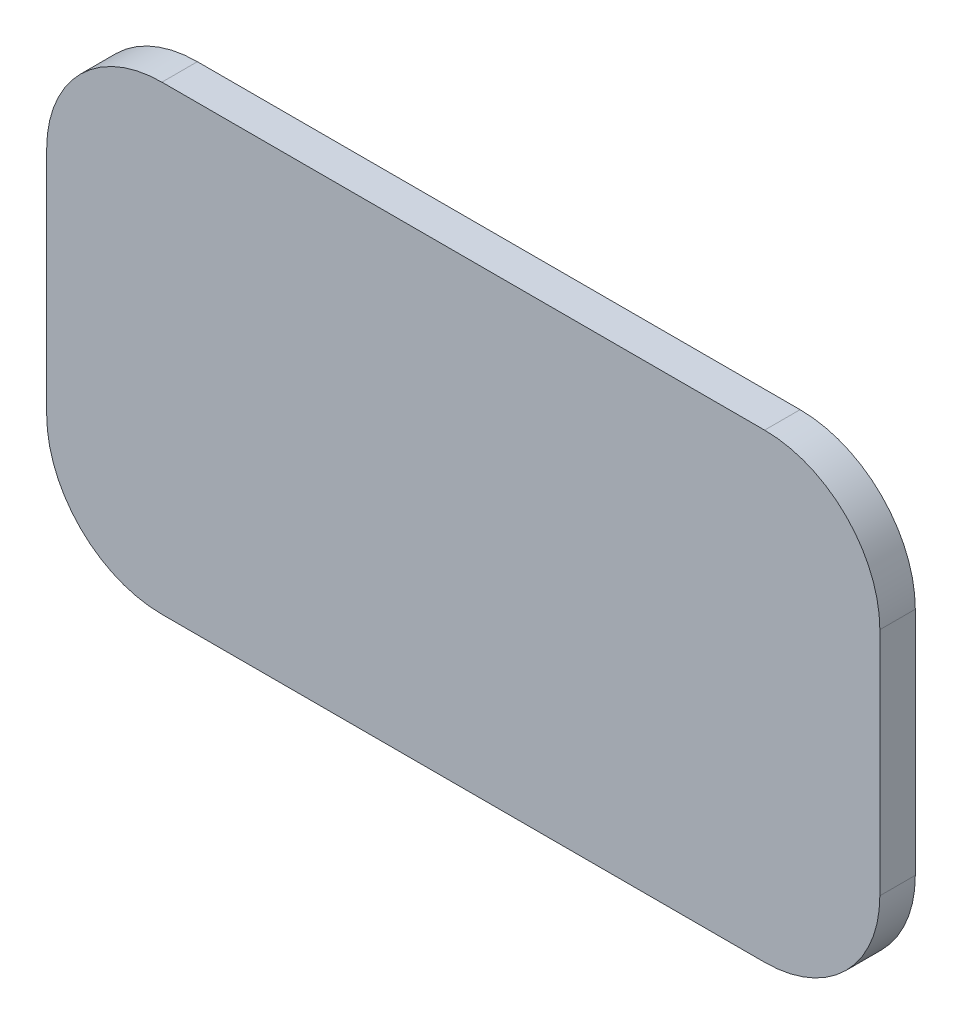
ISO-10303-21;
HEADER;
FILE_DESCRIPTION(('STEP AP214'),'2;1');
FILE_NAME('part.step','',(''),(''),'','','');
FILE_SCHEMA(('AUTOMOTIVE_DESIGN { 1 0 10303 214 1 1 1 1 }'));
ENDSEC;
DATA;
#1=APPLICATION_CONTEXT('core data for automotive mechanical design processes');
#2=APPLICATION_PROTOCOL_DEFINITION('international standard','automotive_design',2000,#1);
#3=PRODUCT_CONTEXT('',#1,'mechanical');
#4=PRODUCT('Part','Part','',(#3));
#5=PRODUCT_RELATED_PRODUCT_CATEGORY('part','',(#4));
#6=PRODUCT_DEFINITION_FORMATION('','',#4);
#7=PRODUCT_DEFINITION_CONTEXT('part definition',#1,'design');
#8=PRODUCT_DEFINITION('design','',#6,#7);
#9=PRODUCT_DEFINITION_SHAPE('','',#8);
#10=(LENGTH_UNIT() NAMED_UNIT(*) SI_UNIT(.MILLI.,.METRE.));
#11=(NAMED_UNIT(*) PLANE_ANGLE_UNIT() SI_UNIT($,.RADIAN.));
#12=(NAMED_UNIT(*) SI_UNIT($,.STERADIAN.) SOLID_ANGLE_UNIT());
#13=UNCERTAINTY_MEASURE_WITH_UNIT(LENGTH_MEASURE(1.E-05),#10,'distance_accuracy_value','');
#14=(GEOMETRIC_REPRESENTATION_CONTEXT(3) GLOBAL_UNCERTAINTY_ASSIGNED_CONTEXT((#13)) GLOBAL_UNIT_ASSIGNED_CONTEXT((#10,
#11,#12)) REPRESENTATION_CONTEXT('',''));
#15=CARTESIAN_POINT('',(0.,0.,0.));
#16=DIRECTION('',(0.,0.,1.));
#17=DIRECTION('',(1.,0.,0.));
#18=AXIS2_PLACEMENT_3D('',#15,#16,#17);
#19=CARTESIAN_POINT('',(-34.,13.,4.));
#20=DIRECTION('',(0.,0.,-1.));
#21=DIRECTION('',(-1.,0.,0.));
#22=AXIS2_PLACEMENT_3D('',#19,#20,#21);
#23=CYLINDRICAL_SURFACE('',#22,13.);
#24=CARTESIAN_POINT('',(-34.,13.,0.));
#25=DIRECTION('',(0.,0.,1.));
#26=DIRECTION('',(1.,0.,0.));
#27=AXIS2_PLACEMENT_3D('',#24,#25,#26);
#28=CIRCLE('',#27,13.);
#29=CARTESIAN_POINT('',(-34.,26.,0.));
#30=VERTEX_POINT('',#29);
#31=CARTESIAN_POINT('',(-47.,13.,0.));
#32=VERTEX_POINT('',#31);
#33=EDGE_CURVE('E130',#30,#32,#28,.T.);
#34=ORIENTED_EDGE('',*,*,#33,.T.);
#35=DIRECTION('',(0.,0.,-1.));
#36=VECTOR('',#35,1.);
#37=CARTESIAN_POINT('',(-47.,13.,4.));
#38=LINE('',#37,#36);
#39=CARTESIAN_POINT('',(-47.,13.,4.));
#40=VERTEX_POINT('',#39);
#41=EDGE_CURVE('E11',#40,#32,#38,.T.);
#42=ORIENTED_EDGE('',*,*,#41,.F.);
#43=CARTESIAN_POINT('',(-34.,13.,4.));
#44=DIRECTION('',(0.,0.,1.));
#45=DIRECTION('',(1.,0.,0.));
#46=AXIS2_PLACEMENT_3D('',#43,#44,#45);
#47=CIRCLE('',#46,13.);
#48=CARTESIAN_POINT('',(-34.,26.,4.));
#49=VERTEX_POINT('',#48);
#50=EDGE_CURVE('E144',#49,#40,#47,.T.);
#51=ORIENTED_EDGE('',*,*,#50,.F.);
#52=DIRECTION('',(0.,0.,-1.));
#53=VECTOR('',#52,1.);
#54=CARTESIAN_POINT('',(-34.,26.,4.));
#55=LINE('',#54,#53);
#56=EDGE_CURVE('E126',#49,#30,#55,.T.);
#57=ORIENTED_EDGE('',*,*,#56,.T.);
#58=EDGE_LOOP('',(#34,#42,#51,#57));
#59=FACE_BOUND('',#58,.T.);
#60=ADVANCED_FACE('F34',(#59),#23,.T.);
#61=CARTESIAN_POINT('',(-47.,-13.,4.));
#62=DIRECTION('',(1.,0.,0.));
#63=DIRECTION('',(0.,1.,0.));
#64=AXIS2_PLACEMENT_3D('',#61,#62,#63);
#65=PLANE('',#64);
#66=DIRECTION('',(0.,-1.,0.));
#67=VECTOR('',#66,1.);
#68=CARTESIAN_POINT('',(-47.,-13.,0.));
#69=LINE('',#68,#67);
#70=CARTESIAN_POINT('',(-47.,-13.,0.));
#71=VERTEX_POINT('',#70);
#72=EDGE_CURVE('E133',#32,#71,#69,.T.);
#73=ORIENTED_EDGE('',*,*,#72,.T.);
#74=DIRECTION('',(0.,0.,-1.));
#75=VECTOR('',#74,1.);
#76=CARTESIAN_POINT('',(-47.,-13.,4.));
#77=LINE('',#76,#75);
#78=CARTESIAN_POINT('',(-47.,-13.,4.));
#79=VERTEX_POINT('',#78);
#80=EDGE_CURVE('E42',#79,#71,#77,.T.);
#81=ORIENTED_EDGE('',*,*,#80,.F.);
#82=DIRECTION('',(0.,-1.,0.));
#83=VECTOR('',#82,1.);
#84=CARTESIAN_POINT('',(-47.,-13.,4.));
#85=LINE('',#84,#83);
#86=EDGE_CURVE('E93',#40,#79,#85,.T.);
#87=ORIENTED_EDGE('',*,*,#86,.F.);
#88=ORIENTED_EDGE('',*,*,#41,.T.);
#89=EDGE_LOOP('',(#73,#81,#87,#88));
#90=FACE_BOUND('',#89,.T.);
#91=ADVANCED_FACE('F179',(#90),#65,.F.);
#92=CARTESIAN_POINT('',(-34.,-13.,4.));
#93=DIRECTION('',(0.,0.,-1.));
#94=DIRECTION('',(-1.,0.,0.));
#95=AXIS2_PLACEMENT_3D('',#92,#93,#94);
#96=CYLINDRICAL_SURFACE('',#95,13.);
#97=CARTESIAN_POINT('',(-34.,-13.,0.));
#98=DIRECTION('',(0.,0.,1.));
#99=DIRECTION('',(1.,0.,0.));
#100=AXIS2_PLACEMENT_3D('',#97,#98,#99);
#101=CIRCLE('',#100,13.);
#102=CARTESIAN_POINT('',(-34.,-26.,0.));
#103=VERTEX_POINT('',#102);
#104=EDGE_CURVE('E135',#71,#103,#101,.T.);
#105=ORIENTED_EDGE('',*,*,#104,.T.);
#106=DIRECTION('',(0.,0.,-1.));
#107=VECTOR('',#106,1.);
#108=CARTESIAN_POINT('',(-34.,-26.,4.));
#109=LINE('',#108,#107);
#110=CARTESIAN_POINT('',(-34.,-26.,4.));
#111=VERTEX_POINT('',#110);
#112=EDGE_CURVE('E151',#111,#103,#109,.T.);
#113=ORIENTED_EDGE('',*,*,#112,.F.);
#114=CARTESIAN_POINT('',(-34.,-13.,4.));
#115=DIRECTION('',(0.,0.,1.));
#116=DIRECTION('',(1.,0.,0.));
#117=AXIS2_PLACEMENT_3D('',#114,#115,#116);
#118=CIRCLE('',#117,13.);
#119=EDGE_CURVE('E159',#79,#111,#118,.T.);
#120=ORIENTED_EDGE('',*,*,#119,.F.);
#121=ORIENTED_EDGE('',*,*,#80,.T.);
#122=EDGE_LOOP('',(#105,#113,#120,#121));
#123=FACE_BOUND('',#122,.T.);
#124=ADVANCED_FACE('F157',(#123),#96,.T.);
#125=CARTESIAN_POINT('',(34.,-26.,4.));
#126=DIRECTION('',(0.,1.,0.));
#127=DIRECTION('',(-1.,0.,0.));
#128=AXIS2_PLACEMENT_3D('',#125,#126,#127);
#129=PLANE('',#128);
#130=DIRECTION('',(1.,0.,0.));
#131=VECTOR('',#130,1.);
#132=CARTESIAN_POINT('',(34.,-26.,0.));
#133=LINE('',#132,#131);
#134=CARTESIAN_POINT('',(34.,-26.,0.));
#135=VERTEX_POINT('',#134);
#136=EDGE_CURVE('E137',#103,#135,#133,.T.);
#137=ORIENTED_EDGE('',*,*,#136,.T.);
#138=DIRECTION('',(0.,0.,-1.));
#139=VECTOR('',#138,1.);
#140=CARTESIAN_POINT('',(34.,-26.,4.));
#141=LINE('',#140,#139);
#142=CARTESIAN_POINT('',(34.,-26.,4.));
#143=VERTEX_POINT('',#142);
#144=EDGE_CURVE('E148',#143,#135,#141,.T.);
#145=ORIENTED_EDGE('',*,*,#144,.F.);
#146=DIRECTION('',(1.,0.,0.));
#147=VECTOR('',#146,1.);
#148=CARTESIAN_POINT('',(34.,-26.,4.));
#149=LINE('',#148,#147);
#150=EDGE_CURVE('E171',#111,#143,#149,.T.);
#151=ORIENTED_EDGE('',*,*,#150,.F.);
#152=ORIENTED_EDGE('',*,*,#112,.T.);
#153=EDGE_LOOP('',(#137,#145,#151,#152));
#154=FACE_BOUND('',#153,.T.);
#155=ADVANCED_FACE('F167',(#154),#129,.F.);
#156=CARTESIAN_POINT('',(34.,-13.,4.));
#157=DIRECTION('',(0.,0.,-1.));
#158=DIRECTION('',(-1.,0.,0.));
#159=AXIS2_PLACEMENT_3D('',#156,#157,#158);
#160=CYLINDRICAL_SURFACE('',#159,13.);
#161=CARTESIAN_POINT('',(34.,-13.,0.));
#162=DIRECTION('',(0.,0.,1.));
#163=DIRECTION('',(1.,0.,0.));
#164=AXIS2_PLACEMENT_3D('',#161,#162,#163);
#165=CIRCLE('',#164,13.);
#166=CARTESIAN_POINT('',(47.,-13.,0.));
#167=VERTEX_POINT('',#166);
#168=EDGE_CURVE('E139',#135,#167,#165,.T.);
#169=ORIENTED_EDGE('',*,*,#168,.T.);
#170=DIRECTION('',(0.,0.,-1.));
#171=VECTOR('',#170,1.);
#172=CARTESIAN_POINT('',(47.,-13.,4.));
#173=LINE('',#172,#171);
#174=CARTESIAN_POINT('',(47.,-13.,4.));
#175=VERTEX_POINT('',#174);
#176=EDGE_CURVE('E121',#175,#167,#173,.T.);
#177=ORIENTED_EDGE('',*,*,#176,.F.);
#178=CARTESIAN_POINT('',(34.,-13.,4.));
#179=DIRECTION('',(0.,0.,1.));
#180=DIRECTION('',(1.,0.,0.));
#181=AXIS2_PLACEMENT_3D('',#178,#179,#180);
#182=CIRCLE('',#181,13.);
#183=EDGE_CURVE('E112',#143,#175,#182,.T.);
#184=ORIENTED_EDGE('',*,*,#183,.F.);
#185=ORIENTED_EDGE('',*,*,#144,.T.);
#186=EDGE_LOOP('',(#169,#177,#184,#185));
#187=FACE_BOUND('',#186,.T.);
#188=ADVANCED_FACE('F170',(#187),#160,.T.);
#189=CARTESIAN_POINT('',(47.,13.,4.));
#190=DIRECTION('',(-1.,0.,0.));
#191=DIRECTION('',(0.,-1.,0.));
#192=AXIS2_PLACEMENT_3D('',#189,#190,#191);
#193=PLANE('',#192);
#194=DIRECTION('',(0.,1.,0.));
#195=VECTOR('',#194,1.);
#196=CARTESIAN_POINT('',(47.,13.,0.));
#197=LINE('',#196,#195);
#198=CARTESIAN_POINT('',(47.,13.,0.));
#199=VERTEX_POINT('',#198);
#200=EDGE_CURVE('E120',#167,#199,#197,.T.);
#201=ORIENTED_EDGE('',*,*,#200,.T.);
#202=DIRECTION('',(0.,0.,-1.));
#203=VECTOR('',#202,1.);
#204=CARTESIAN_POINT('',(47.,13.,4.));
#205=LINE('',#204,#203);
#206=CARTESIAN_POINT('',(47.,13.,4.));
#207=VERTEX_POINT('',#206);
#208=EDGE_CURVE('E117',#207,#199,#205,.T.);
#209=ORIENTED_EDGE('',*,*,#208,.F.);
#210=DIRECTION('',(0.,1.,0.));
#211=VECTOR('',#210,1.);
#212=CARTESIAN_POINT('',(47.,13.,4.));
#213=LINE('',#212,#211);
#214=EDGE_CURVE('E106',#175,#207,#213,.T.);
#215=ORIENTED_EDGE('',*,*,#214,.F.);
#216=ORIENTED_EDGE('',*,*,#176,.T.);
#217=EDGE_LOOP('',(#201,#209,#215,#216));
#218=FACE_BOUND('',#217,.T.);
#219=ADVANCED_FACE('F118',(#218),#193,.F.);
#220=CARTESIAN_POINT('',(34.,13.,4.));
#221=DIRECTION('',(0.,0.,-1.));
#222=DIRECTION('',(-1.,0.,0.));
#223=AXIS2_PLACEMENT_3D('',#220,#221,#222);
#224=CYLINDRICAL_SURFACE('',#223,13.);
#225=CARTESIAN_POINT('',(34.,13.,0.));
#226=DIRECTION('',(0.,0.,1.));
#227=DIRECTION('',(1.,0.,0.));
#228=AXIS2_PLACEMENT_3D('',#225,#226,#227);
#229=CIRCLE('',#228,13.);
#230=CARTESIAN_POINT('',(34.,26.,0.));
#231=VERTEX_POINT('',#230);
#232=EDGE_CURVE('E79',#199,#231,#229,.T.);
#233=ORIENTED_EDGE('',*,*,#232,.T.);
#234=DIRECTION('',(0.,0.,-1.));
#235=VECTOR('',#234,1.);
#236=CARTESIAN_POINT('',(34.,26.,4.));
#237=LINE('',#236,#235);
#238=CARTESIAN_POINT('',(34.,26.,4.));
#239=VERTEX_POINT('',#238);
#240=EDGE_CURVE('E122',#239,#231,#237,.T.);
#241=ORIENTED_EDGE('',*,*,#240,.F.);
#242=CARTESIAN_POINT('',(34.,13.,4.));
#243=DIRECTION('',(0.,0.,1.));
#244=DIRECTION('',(1.,0.,0.));
#245=AXIS2_PLACEMENT_3D('',#242,#243,#244);
#246=CIRCLE('',#245,13.);
#247=EDGE_CURVE('E110',#207,#239,#246,.T.);
#248=ORIENTED_EDGE('',*,*,#247,.F.);
#249=ORIENTED_EDGE('',*,*,#208,.T.);
#250=EDGE_LOOP('',(#233,#241,#248,#249));
#251=FACE_BOUND('',#250,.T.);
#252=ADVANCED_FACE('F124',(#251),#224,.T.);
#253=CARTESIAN_POINT('',(-34.,26.,4.));
#254=DIRECTION('',(0.,-1.,0.));
#255=DIRECTION('',(0.,0.,-1.));
#256=AXIS2_PLACEMENT_3D('',#253,#254,#255);
#257=PLANE('',#256);
#258=DIRECTION('',(-1.,0.,0.));
#259=VECTOR('',#258,1.);
#260=CARTESIAN_POINT('',(-34.,26.,0.));
#261=LINE('',#260,#259);
#262=EDGE_CURVE('E85',#231,#30,#261,.T.);
#263=ORIENTED_EDGE('',*,*,#262,.T.);
#264=ORIENTED_EDGE('',*,*,#56,.F.);
#265=DIRECTION('',(-1.,0.,0.));
#266=VECTOR('',#265,1.);
#267=CARTESIAN_POINT('',(-34.,26.,4.));
#268=LINE('',#267,#266);
#269=EDGE_CURVE('E50',#239,#49,#268,.T.);
#270=ORIENTED_EDGE('',*,*,#269,.F.);
#271=ORIENTED_EDGE('',*,*,#240,.T.);
#272=EDGE_LOOP('',(#263,#264,#270,#271));
#273=FACE_BOUND('',#272,.T.);
#274=ADVANCED_FACE('F195',(#273),#257,.F.);
#275=CARTESIAN_POINT('',(-34.,13.,4.));
#276=DIRECTION('',(0.,0.,1.));
#277=DIRECTION('',(1.,0.,0.));
#278=AXIS2_PLACEMENT_3D('',#275,#276,#277);
#279=PLANE('',#278);
#280=ORIENTED_EDGE('',*,*,#50,.T.);
#281=ORIENTED_EDGE('',*,*,#86,.T.);
#282=ORIENTED_EDGE('',*,*,#119,.T.);
#283=ORIENTED_EDGE('',*,*,#150,.T.);
#284=ORIENTED_EDGE('',*,*,#183,.T.);
#285=ORIENTED_EDGE('',*,*,#214,.T.);
#286=ORIENTED_EDGE('',*,*,#247,.T.);
#287=ORIENTED_EDGE('',*,*,#269,.T.);
#288=EDGE_LOOP('',(#280,#281,#282,#283,#284,#285,#286,#287));
#289=FACE_BOUND('',#288,.T.);
#290=ADVANCED_FACE('F108',(#289),#279,.T.);
#291=CARTESIAN_POINT('',(-34.,13.,0.));
#292=DIRECTION('',(0.,0.,1.));
#293=DIRECTION('',(1.,0.,0.));
#294=AXIS2_PLACEMENT_3D('',#291,#292,#293);
#295=PLANE('',#294);
#296=ORIENTED_EDGE('',*,*,#33,.F.);
#297=ORIENTED_EDGE('',*,*,#262,.F.);
#298=ORIENTED_EDGE('',*,*,#232,.F.);
#299=ORIENTED_EDGE('',*,*,#200,.F.);
#300=ORIENTED_EDGE('',*,*,#168,.F.);
#301=ORIENTED_EDGE('',*,*,#136,.F.);
#302=ORIENTED_EDGE('',*,*,#104,.F.);
#303=ORIENTED_EDGE('',*,*,#72,.F.);
#304=EDGE_LOOP('',(#296,#297,#298,#299,#300,#301,#302,#303));
#305=FACE_BOUND('',#304,.T.);
#306=ADVANCED_FACE('F163',(#305),#295,.F.);
#307=CLOSED_SHELL('',(#60,#91,#124,#155,#188,#219,#252,#274,#290,#306));
#308=MANIFOLD_SOLID_BREP('B2',#307);
#309=ADVANCED_BREP_SHAPE_REPRESENTATION('',(#18,#308),#14);
#310=SHAPE_DEFINITION_REPRESENTATION(#9,#309);
ENDSEC;
END-ISO-10303-21;
